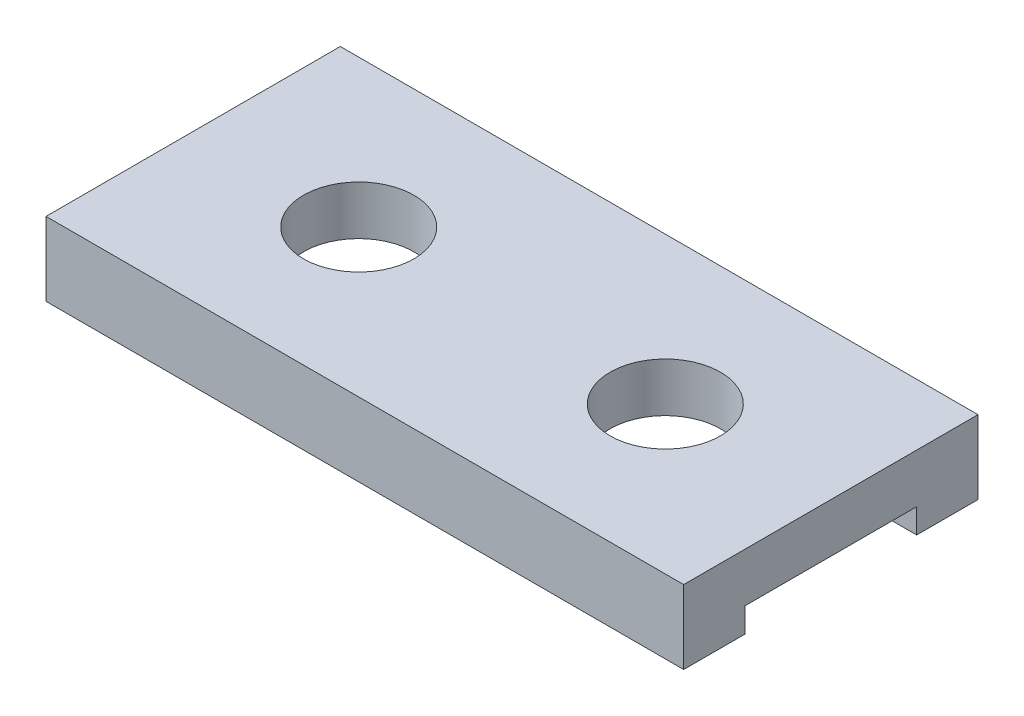
ISO-10303-21;
HEADER;
FILE_DESCRIPTION(('STEP AP214'),'2;1');
FILE_NAME('part.step','',(''),(''),'','','');
FILE_SCHEMA(('AUTOMOTIVE_DESIGN { 1 0 10303 214 1 1 1 1 }'));
ENDSEC;
DATA;
#1=APPLICATION_CONTEXT('core data for automotive mechanical design processes');
#2=APPLICATION_PROTOCOL_DEFINITION('international standard','automotive_design',2000,#1);
#3=PRODUCT_CONTEXT('',#1,'mechanical');
#4=PRODUCT('Part','Part','',(#3));
#5=PRODUCT_RELATED_PRODUCT_CATEGORY('part','',(#4));
#6=PRODUCT_DEFINITION_FORMATION('','',#4);
#7=PRODUCT_DEFINITION_CONTEXT('part definition',#1,'design');
#8=PRODUCT_DEFINITION('design','',#6,#7);
#9=PRODUCT_DEFINITION_SHAPE('','',#8);
#10=(LENGTH_UNIT() NAMED_UNIT(*) SI_UNIT(.MILLI.,.METRE.));
#11=(NAMED_UNIT(*) PLANE_ANGLE_UNIT() SI_UNIT($,.RADIAN.));
#12=(NAMED_UNIT(*) SI_UNIT($,.STERADIAN.) SOLID_ANGLE_UNIT());
#13=UNCERTAINTY_MEASURE_WITH_UNIT(LENGTH_MEASURE(1.E-05),#10,'distance_accuracy_value','');
#14=(GEOMETRIC_REPRESENTATION_CONTEXT(3) GLOBAL_UNCERTAINTY_ASSIGNED_CONTEXT((#13)) GLOBAL_UNIT_ASSIGNED_CONTEXT((#10,
#11,#12)) REPRESENTATION_CONTEXT('',''));
#15=CARTESIAN_POINT('',(0.,0.,0.));
#16=DIRECTION('',(0.,0.,1.));
#17=DIRECTION('',(1.,0.,0.));
#18=AXIS2_PLACEMENT_3D('',#15,#16,#17);
#19=CARTESIAN_POINT('',(-13.,-3.,6.));
#20=DIRECTION('',(0.,1.,0.));
#21=DIRECTION('',(0.,0.,1.));
#22=AXIS2_PLACEMENT_3D('',#19,#20,#21);
#23=PLANE('',#22);
#24=DIRECTION('',(0.,0.,1.));
#25=VECTOR('',#24,1.);
#26=CARTESIAN_POINT('',(-13.,-3.,-6.));
#27=LINE('',#26,#25);
#28=CARTESIAN_POINT('',(-13.,-3.,3.50000000000001));
#29=VERTEX_POINT('',#28);
#30=CARTESIAN_POINT('',(-13.,-3.,6.));
#31=VERTEX_POINT('',#30);
#32=EDGE_CURVE('E82',#29,#31,#27,.T.);
#33=ORIENTED_EDGE('',*,*,#32,.F.);
#34=DIRECTION('',(1.,0.,0.));
#35=VECTOR('',#34,1.);
#36=CARTESIAN_POINT('',(-13.,-3.,3.50000000000001));
#37=LINE('',#36,#35);
#38=CARTESIAN_POINT('',(13.,-3.,3.5));
#39=VERTEX_POINT('',#38);
#40=EDGE_CURVE('E106',#29,#39,#37,.T.);
#41=ORIENTED_EDGE('',*,*,#40,.T.);
#42=DIRECTION('',(0.,0.,-1.));
#43=VECTOR('',#42,1.);
#44=CARTESIAN_POINT('',(13.,-3.,-6.));
#45=LINE('',#44,#43);
#46=CARTESIAN_POINT('',(13.,-3.,6.));
#47=VERTEX_POINT('',#46);
#48=EDGE_CURVE('E136',#47,#39,#45,.T.);
#49=ORIENTED_EDGE('',*,*,#48,.F.);
#50=DIRECTION('',(1.,0.,0.));
#51=VECTOR('',#50,1.);
#52=CARTESIAN_POINT('',(-13.,-3.,6.));
#53=LINE('',#52,#51);
#54=EDGE_CURVE('E123',#31,#47,#53,.T.);
#55=ORIENTED_EDGE('',*,*,#54,.F.);
#56=EDGE_LOOP('',(#33,#41,#49,#55));
#57=FACE_BOUND('',#56,.T.);
#58=ADVANCED_FACE('F33',(#57),#23,.F.);
#59=CARTESIAN_POINT('',(-13.,-3.,-6.));
#60=DIRECTION('',(-1.,0.,0.));
#61=DIRECTION('',(0.,0.,1.));
#62=AXIS2_PLACEMENT_3D('',#59,#60,#61);
#63=PLANE('',#62);
#64=DIRECTION('',(0.,-1.,0.));
#65=VECTOR('',#64,1.);
#66=CARTESIAN_POINT('',(-13.,-3.,3.50000000000001));
#67=LINE('',#66,#65);
#68=CARTESIAN_POINT('',(-13.,-2.,3.50000000000001));
#69=VERTEX_POINT('',#68);
#70=EDGE_CURVE('E108',#69,#29,#67,.T.);
#71=ORIENTED_EDGE('',*,*,#70,.T.);
#72=ORIENTED_EDGE('',*,*,#32,.T.);
#73=DIRECTION('',(0.,1.,0.));
#74=VECTOR('',#73,1.);
#75=CARTESIAN_POINT('',(-13.,-3.,6.));
#76=LINE('',#75,#74);
#77=CARTESIAN_POINT('',(-13.,0.,6.));
#78=VERTEX_POINT('',#77);
#79=EDGE_CURVE('E140',#31,#78,#76,.T.);
#80=ORIENTED_EDGE('',*,*,#79,.T.);
#81=DIRECTION('',(0.,0.,1.));
#82=VECTOR('',#81,1.);
#83=CARTESIAN_POINT('',(-13.,0.,-6.));
#84=LINE('',#83,#82);
#85=CARTESIAN_POINT('',(-13.,0.,-6.));
#86=VERTEX_POINT('',#85);
#87=EDGE_CURVE('E141',#86,#78,#84,.T.);
#88=ORIENTED_EDGE('',*,*,#87,.F.);
#89=DIRECTION('',(0.,1.,0.));
#90=VECTOR('',#89,1.);
#91=CARTESIAN_POINT('',(-13.,-3.,-6.));
#92=LINE('',#91,#90);
#93=CARTESIAN_POINT('',(-13.,-3.,-6.));
#94=VERTEX_POINT('',#93);
#95=EDGE_CURVE('E11',#94,#86,#92,.T.);
#96=ORIENTED_EDGE('',*,*,#95,.F.);
#97=CARTESIAN_POINT('',(-13.,-3.,-3.49999999999999));
#98=VERTEX_POINT('',#97);
#99=EDGE_CURVE('E124',#94,#98,#27,.T.);
#100=ORIENTED_EDGE('',*,*,#99,.T.);
#101=DIRECTION('',(0.,1.,0.));
#102=VECTOR('',#101,1.);
#103=CARTESIAN_POINT('',(-13.,-3.,-3.49999999999999));
#104=LINE('',#103,#102);
#105=CARTESIAN_POINT('',(-13.,-2.,-3.49999999999999));
#106=VERTEX_POINT('',#105);
#107=EDGE_CURVE('E50',#98,#106,#104,.T.);
#108=ORIENTED_EDGE('',*,*,#107,.T.);
#109=DIRECTION('',(0.,0.,1.));
#110=VECTOR('',#109,1.);
#111=CARTESIAN_POINT('',(-13.,-2.,3.50000000000001));
#112=LINE('',#111,#110);
#113=EDGE_CURVE('E116',#106,#69,#112,.T.);
#114=ORIENTED_EDGE('',*,*,#113,.T.);
#115=EDGE_LOOP('',(#71,#72,#80,#88,#96,#100,#108,#114));
#116=FACE_BOUND('',#115,.T.);
#117=ADVANCED_FACE('F35',(#116),#63,.T.);
#118=CARTESIAN_POINT('',(-13.,-3.,-6.));
#119=DIRECTION('',(0.,0.,-1.));
#120=DIRECTION('',(-1.,0.,0.));
#121=AXIS2_PLACEMENT_3D('',#118,#119,#120);
#122=PLANE('',#121);
#123=DIRECTION('',(-1.,0.,0.));
#124=VECTOR('',#123,1.);
#125=CARTESIAN_POINT('',(-13.,0.,-6.));
#126=LINE('',#125,#124);
#127=CARTESIAN_POINT('',(13.,0.,-6.));
#128=VERTEX_POINT('',#127);
#129=EDGE_CURVE('E125',#128,#86,#126,.T.);
#130=ORIENTED_EDGE('',*,*,#129,.F.);
#131=DIRECTION('',(0.,1.,0.));
#132=VECTOR('',#131,1.);
#133=CARTESIAN_POINT('',(13.,-3.,-6.));
#134=LINE('',#133,#132);
#135=CARTESIAN_POINT('',(13.,-3.,-6.));
#136=VERTEX_POINT('',#135);
#137=EDGE_CURVE('E42',#136,#128,#134,.T.);
#138=ORIENTED_EDGE('',*,*,#137,.F.);
#139=DIRECTION('',(-1.,0.,0.));
#140=VECTOR('',#139,1.);
#141=CARTESIAN_POINT('',(-13.,-3.,-6.));
#142=LINE('',#141,#140);
#143=EDGE_CURVE('E138',#136,#94,#142,.T.);
#144=ORIENTED_EDGE('',*,*,#143,.T.);
#145=ORIENTED_EDGE('',*,*,#95,.T.);
#146=EDGE_LOOP('',(#130,#138,#144,#145));
#147=FACE_BOUND('',#146,.T.);
#148=ADVANCED_FACE('F158',(#147),#122,.T.);
#149=CARTESIAN_POINT('',(13.,-3.,-6.));
#150=DIRECTION('',(1.,0.,0.));
#151=DIRECTION('',(0.,0.,-1.));
#152=AXIS2_PLACEMENT_3D('',#149,#150,#151);
#153=PLANE('',#152);
#154=DIRECTION('',(0.,-1.,0.));
#155=VECTOR('',#154,1.);
#156=CARTESIAN_POINT('',(13.,-3.,3.5));
#157=LINE('',#156,#155);
#158=CARTESIAN_POINT('',(13.,-2.,3.5));
#159=VERTEX_POINT('',#158);
#160=EDGE_CURVE('E111',#159,#39,#157,.T.);
#161=ORIENTED_EDGE('',*,*,#160,.F.);
#162=DIRECTION('',(0.,0.,1.));
#163=VECTOR('',#162,1.);
#164=CARTESIAN_POINT('',(13.,-2.,3.5));
#165=LINE('',#164,#163);
#166=CARTESIAN_POINT('',(13.,-2.,-3.5));
#167=VERTEX_POINT('',#166);
#168=EDGE_CURVE('E119',#167,#159,#165,.T.);
#169=ORIENTED_EDGE('',*,*,#168,.F.);
#170=DIRECTION('',(0.,1.,0.));
#171=VECTOR('',#170,1.);
#172=CARTESIAN_POINT('',(13.,-3.,-3.5));
#173=LINE('',#172,#171);
#174=CARTESIAN_POINT('',(13.,-3.,-3.5));
#175=VERTEX_POINT('',#174);
#176=EDGE_CURVE('E168',#175,#167,#173,.T.);
#177=ORIENTED_EDGE('',*,*,#176,.F.);
#178=EDGE_CURVE('E135',#175,#136,#45,.T.);
#179=ORIENTED_EDGE('',*,*,#178,.T.);
#180=ORIENTED_EDGE('',*,*,#137,.T.);
#181=DIRECTION('',(0.,0.,-1.));
#182=VECTOR('',#181,1.);
#183=CARTESIAN_POINT('',(13.,0.,-6.));
#184=LINE('',#183,#182);
#185=CARTESIAN_POINT('',(13.,0.,6.));
#186=VERTEX_POINT('',#185);
#187=EDGE_CURVE('E128',#186,#128,#184,.T.);
#188=ORIENTED_EDGE('',*,*,#187,.F.);
#189=DIRECTION('',(0.,1.,0.));
#190=VECTOR('',#189,1.);
#191=CARTESIAN_POINT('',(13.,-3.,6.));
#192=LINE('',#191,#190);
#193=EDGE_CURVE('E150',#47,#186,#192,.T.);
#194=ORIENTED_EDGE('',*,*,#193,.F.);
#195=ORIENTED_EDGE('',*,*,#48,.T.);
#196=EDGE_LOOP('',(#161,#169,#177,#179,#180,#188,#194,#195));
#197=FACE_BOUND('',#196,.T.);
#198=ADVANCED_FACE('F226',(#197),#153,.T.);
#199=CARTESIAN_POINT('',(-13.,-3.,6.));
#200=DIRECTION('',(0.,0.,1.));
#201=DIRECTION('',(1.,0.,0.));
#202=AXIS2_PLACEMENT_3D('',#199,#200,#201);
#203=PLANE('',#202);
#204=DIRECTION('',(1.,0.,0.));
#205=VECTOR('',#204,1.);
#206=CARTESIAN_POINT('',(-13.,0.,6.));
#207=LINE('',#206,#205);
#208=EDGE_CURVE('E144',#78,#186,#207,.T.);
#209=ORIENTED_EDGE('',*,*,#208,.F.);
#210=ORIENTED_EDGE('',*,*,#79,.F.);
#211=ORIENTED_EDGE('',*,*,#54,.T.);
#212=ORIENTED_EDGE('',*,*,#193,.T.);
#213=EDGE_LOOP('',(#209,#210,#211,#212));
#214=FACE_BOUND('',#213,.T.);
#215=ADVANCED_FACE('F153',(#214),#203,.T.);
#216=ORIENTED_EDGE('',*,*,#178,.F.);
#217=DIRECTION('',(1.,0.,0.));
#218=VECTOR('',#217,1.);
#219=CARTESIAN_POINT('',(-13.,-3.,-3.49999999999999));
#220=LINE('',#219,#218);
#221=EDGE_CURVE('E115',#98,#175,#220,.T.);
#222=ORIENTED_EDGE('',*,*,#221,.F.);
#223=ORIENTED_EDGE('',*,*,#99,.F.);
#224=ORIENTED_EDGE('',*,*,#143,.F.);
#225=EDGE_LOOP('',(#216,#222,#223,#224));
#226=FACE_BOUND('',#225,.T.);
#227=ADVANCED_FACE('F163',(#226),#23,.F.);
#228=CARTESIAN_POINT('',(-13.,0.,6.));
#229=DIRECTION('',(0.,1.,0.));
#230=DIRECTION('',(0.,0.,1.));
#231=AXIS2_PLACEMENT_3D('',#228,#229,#230);
#232=PLANE('',#231);
#233=CARTESIAN_POINT('',(6.25,0.,0.));
#234=DIRECTION('',(0.,1.,0.));
#235=DIRECTION('',(0.,0.,1.));
#236=AXIS2_PLACEMENT_3D('',#233,#234,#235);
#237=CIRCLE('',#236,2.25);
#238=CARTESIAN_POINT('',(6.25,0.,2.25));
#239=VERTEX_POINT('',#238);
#240=EDGE_CURVE('E180',#239,#239,#237,.T.);
#241=ORIENTED_EDGE('',*,*,#240,.F.);
#242=EDGE_LOOP('',(#241));
#243=FACE_BOUND('',#242,.T.);
#244=CARTESIAN_POINT('',(-6.25,0.,0.));
#245=DIRECTION('',(0.,1.,0.));
#246=DIRECTION('',(0.,0.,1.));
#247=AXIS2_PLACEMENT_3D('',#244,#245,#246);
#248=CIRCLE('',#247,2.25);
#249=CARTESIAN_POINT('',(-6.25,0.,2.25));
#250=VERTEX_POINT('',#249);
#251=EDGE_CURVE('E132',#250,#250,#248,.T.);
#252=ORIENTED_EDGE('',*,*,#251,.F.);
#253=EDGE_LOOP('',(#252));
#254=FACE_BOUND('',#253,.T.);
#255=ORIENTED_EDGE('',*,*,#87,.T.);
#256=ORIENTED_EDGE('',*,*,#208,.T.);
#257=ORIENTED_EDGE('',*,*,#187,.T.);
#258=ORIENTED_EDGE('',*,*,#129,.T.);
#259=EDGE_LOOP('',(#255,#256,#257,#258));
#260=FACE_BOUND('',#259,.T.);
#261=ADVANCED_FACE('F156',(#243,#254,#260),#232,.T.);
#262=CARTESIAN_POINT('',(-6.25,-3.,0.));
#263=DIRECTION('',(0.,1.,0.));
#264=DIRECTION('',(0.,0.,1.));
#265=AXIS2_PLACEMENT_3D('',#262,#263,#264);
#266=CYLINDRICAL_SURFACE('',#265,2.25);
#267=CARTESIAN_POINT('',(-6.25,-2.,0.));
#268=DIRECTION('',(0.,1.,0.));
#269=DIRECTION('',(0.,0.,1.));
#270=AXIS2_PLACEMENT_3D('',#267,#268,#269);
#271=CIRCLE('',#270,2.25);
#272=CARTESIAN_POINT('',(-6.25,-2.,2.25));
#273=VERTEX_POINT('',#272);
#274=EDGE_CURVE('E178',#273,#273,#271,.F.);
#275=ORIENTED_EDGE('',*,*,#274,.T.);
#276=EDGE_LOOP('',(#275));
#277=FACE_BOUND('',#276,.T.);
#278=ORIENTED_EDGE('',*,*,#251,.T.);
#279=EDGE_LOOP('',(#278));
#280=FACE_BOUND('',#279,.T.);
#281=ADVANCED_FACE('F187',(#277,#280),#266,.F.);
#282=CARTESIAN_POINT('',(6.25,-3.,0.));
#283=DIRECTION('',(0.,1.,0.));
#284=DIRECTION('',(0.,0.,1.));
#285=AXIS2_PLACEMENT_3D('',#282,#283,#284);
#286=CYLINDRICAL_SURFACE('',#285,2.25);
#287=CARTESIAN_POINT('',(6.25,-2.,0.));
#288=DIRECTION('',(0.,1.,0.));
#289=DIRECTION('',(0.,0.,1.));
#290=AXIS2_PLACEMENT_3D('',#287,#288,#289);
#291=CIRCLE('',#290,2.25);
#292=CARTESIAN_POINT('',(6.25,-2.,2.25));
#293=VERTEX_POINT('',#292);
#294=EDGE_CURVE('E37',#293,#293,#291,.F.);
#295=ORIENTED_EDGE('',*,*,#294,.T.);
#296=EDGE_LOOP('',(#295));
#297=FACE_BOUND('',#296,.T.);
#298=ORIENTED_EDGE('',*,*,#240,.T.);
#299=EDGE_LOOP('',(#298));
#300=FACE_BOUND('',#299,.T.);
#301=ADVANCED_FACE('F196',(#297,#300),#286,.F.);
#302=CARTESIAN_POINT('',(-13.,-2.,3.50000000000001));
#303=DIRECTION('',(0.,1.,0.));
#304=DIRECTION('',(0.,0.,1.));
#305=AXIS2_PLACEMENT_3D('',#302,#303,#304);
#306=PLANE('',#305);
#307=ORIENTED_EDGE('',*,*,#294,.F.);
#308=EDGE_LOOP('',(#307));
#309=FACE_BOUND('',#308,.T.);
#310=ORIENTED_EDGE('',*,*,#168,.T.);
#311=DIRECTION('',(1.,0.,0.));
#312=VECTOR('',#311,1.);
#313=CARTESIAN_POINT('',(-13.,-2.,3.50000000000001));
#314=LINE('',#313,#312);
#315=EDGE_CURVE('E173',#69,#159,#314,.T.);
#316=ORIENTED_EDGE('',*,*,#315,.F.);
#317=ORIENTED_EDGE('',*,*,#113,.F.);
#318=DIRECTION('',(1.,0.,0.));
#319=VECTOR('',#318,1.);
#320=CARTESIAN_POINT('',(-13.,-2.,-3.49999999999999));
#321=LINE('',#320,#319);
#322=EDGE_CURVE('E175',#106,#167,#321,.T.);
#323=ORIENTED_EDGE('',*,*,#322,.T.);
#324=EDGE_LOOP('',(#310,#316,#317,#323));
#325=FACE_BOUND('',#324,.T.);
#326=ORIENTED_EDGE('',*,*,#274,.F.);
#327=EDGE_LOOP('',(#326));
#328=FACE_BOUND('',#327,.T.);
#329=ADVANCED_FACE('F208',(#309,#325,#328),#306,.F.);
#330=CARTESIAN_POINT('',(-13.,-3.,3.50000000000001));
#331=DIRECTION('',(0.,0.,1.));
#332=DIRECTION('',(1.,0.,0.));
#333=AXIS2_PLACEMENT_3D('',#330,#331,#332);
#334=PLANE('',#333);
#335=ORIENTED_EDGE('',*,*,#160,.T.);
#336=ORIENTED_EDGE('',*,*,#40,.F.);
#337=ORIENTED_EDGE('',*,*,#70,.F.);
#338=ORIENTED_EDGE('',*,*,#315,.T.);
#339=EDGE_LOOP('',(#335,#336,#337,#338));
#340=FACE_BOUND('',#339,.T.);
#341=ADVANCED_FACE('F107',(#340),#334,.F.);
#342=CARTESIAN_POINT('',(-13.,-3.,-3.49999999999999));
#343=DIRECTION('',(0.,0.,-1.));
#344=DIRECTION('',(-1.,0.,0.));
#345=AXIS2_PLACEMENT_3D('',#342,#343,#344);
#346=PLANE('',#345);
#347=ORIENTED_EDGE('',*,*,#176,.T.);
#348=ORIENTED_EDGE('',*,*,#322,.F.);
#349=ORIENTED_EDGE('',*,*,#107,.F.);
#350=ORIENTED_EDGE('',*,*,#221,.T.);
#351=EDGE_LOOP('',(#347,#348,#349,#350));
#352=FACE_BOUND('',#351,.T.);
#353=ADVANCED_FACE('F212',(#352),#346,.F.);
#354=CLOSED_SHELL('',(#58,#117,#148,#198,#215,#227,#261,#281,#301,#329,#341,#353));
#355=MANIFOLD_SOLID_BREP('B2',#354);
#356=ADVANCED_BREP_SHAPE_REPRESENTATION('',(#18,#355),#14);
#357=SHAPE_DEFINITION_REPRESENTATION(#9,#356);
ENDSEC;
END-ISO-10303-21;
